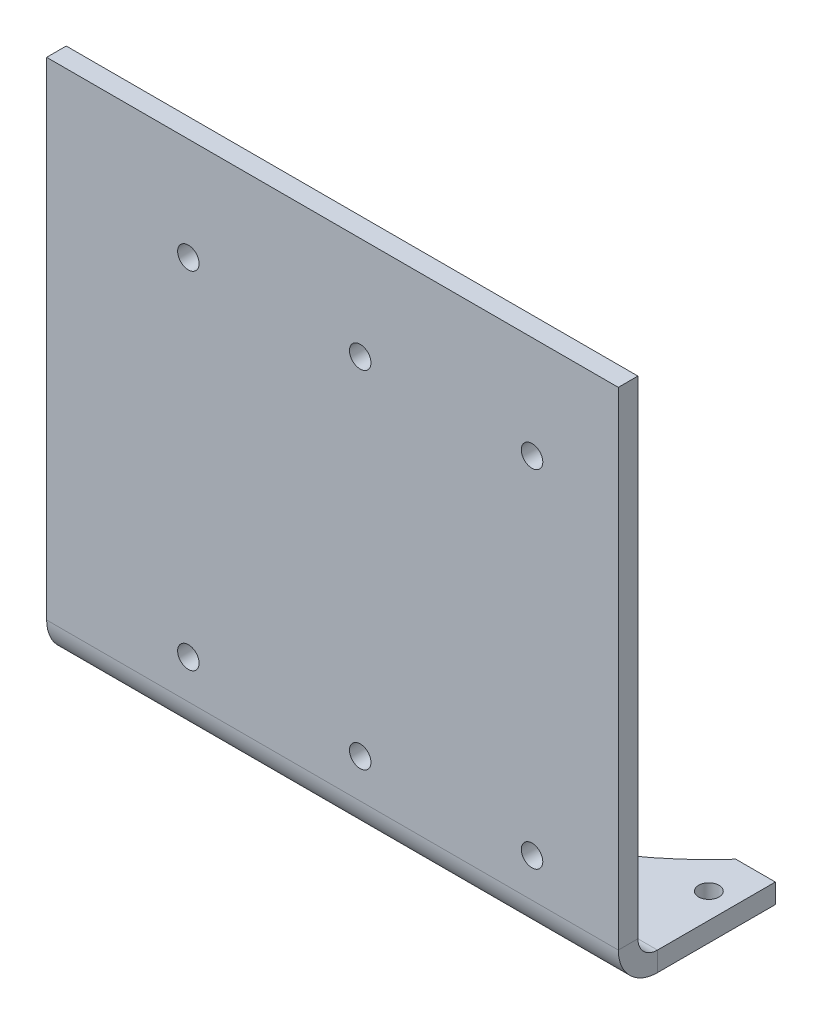
ISO-10303-21;
HEADER;
FILE_DESCRIPTION(('STEP AP214'),'2;1');
FILE_NAME('part.step','',(''),(''),'','','');
FILE_SCHEMA(('AUTOMOTIVE_DESIGN { 1 0 10303 214 1 1 1 1 }'));
ENDSEC;
DATA;
#1=APPLICATION_CONTEXT('core data for automotive mechanical design processes');
#2=APPLICATION_PROTOCOL_DEFINITION('international standard','automotive_design',2000,#1);
#3=PRODUCT_CONTEXT('',#1,'mechanical');
#4=PRODUCT('Part','Part','',(#3));
#5=PRODUCT_RELATED_PRODUCT_CATEGORY('part','',(#4));
#6=PRODUCT_DEFINITION_FORMATION('','',#4);
#7=PRODUCT_DEFINITION_CONTEXT('part definition',#1,'design');
#8=PRODUCT_DEFINITION('design','',#6,#7);
#9=PRODUCT_DEFINITION_SHAPE('','',#8);
#10=(LENGTH_UNIT() NAMED_UNIT(*) SI_UNIT(.MILLI.,.METRE.));
#11=(NAMED_UNIT(*) PLANE_ANGLE_UNIT() SI_UNIT($,.RADIAN.));
#12=(NAMED_UNIT(*) SI_UNIT($,.STERADIAN.) SOLID_ANGLE_UNIT());
#13=UNCERTAINTY_MEASURE_WITH_UNIT(LENGTH_MEASURE(1.E-05),#10,'distance_accuracy_value','');
#14=(GEOMETRIC_REPRESENTATION_CONTEXT(3) GLOBAL_UNCERTAINTY_ASSIGNED_CONTEXT((#13)) GLOBAL_UNIT_ASSIGNED_CONTEXT((#10,
#11,#12)) REPRESENTATION_CONTEXT('',''));
#15=CARTESIAN_POINT('',(0.,0.,0.));
#16=DIRECTION('',(0.,0.,1.));
#17=DIRECTION('',(1.,0.,0.));
#18=AXIS2_PLACEMENT_3D('',#15,#16,#17);
#19=CARTESIAN_POINT('',(84.5,-73.66,-40.64));
#20=DIRECTION('',(1.,0.,0.));
#21=DIRECTION('',(0.,0.,1.));
#22=AXIS2_PLACEMENT_3D('',#19,#20,#21);
#23=PLANE('',#22);
#24=DIRECTION('',(0.,1.,0.));
#25=VECTOR('',#24,1.);
#26=CARTESIAN_POINT('',(84.5,-73.66,-5.790000104));
#27=LINE('',#26,#25);
#28=CARTESIAN_POINT('',(84.5,-79.4500062,-5.790000104));
#29=VERTEX_POINT('',#28);
#30=CARTESIAN_POINT('',(84.5,-73.66,-5.790000104));
#31=VERTEX_POINT('',#30);
#32=EDGE_CURVE('E11',#29,#31,#27,.T.);
#33=ORIENTED_EDGE('',*,*,#32,.F.);
#34=DIRECTION('',(0.,0.,1.));
#35=VECTOR('',#34,1.);
#36=CARTESIAN_POINT('',(84.5,-79.4500062,-40.64));
#37=LINE('',#36,#35);
#38=CARTESIAN_POINT('',(84.5,-79.4500062,-40.64));
#39=VERTEX_POINT('',#38);
#40=EDGE_CURVE('E92',#39,#29,#37,.T.);
#41=ORIENTED_EDGE('',*,*,#40,.F.);
#42=DIRECTION('',(0.,1.,0.));
#43=VECTOR('',#42,1.);
#44=CARTESIAN_POINT('',(84.5,-73.66,-40.64));
#45=LINE('',#44,#43);
#46=CARTESIAN_POINT('',(84.5,-73.66,-40.64));
#47=VERTEX_POINT('',#46);
#48=EDGE_CURVE('E47',#39,#47,#45,.T.);
#49=ORIENTED_EDGE('',*,*,#48,.T.);
#50=DIRECTION('',(0.,0.,1.));
#51=VECTOR('',#50,1.);
#52=CARTESIAN_POINT('',(84.5,-73.66,-40.64));
#53=LINE('',#52,#51);
#54=EDGE_CURVE('E94',#47,#31,#53,.T.);
#55=ORIENTED_EDGE('',*,*,#54,.T.);
#56=EDGE_LOOP('',(#33,#41,#49,#55));
#57=FACE_BOUND('',#56,.T.);
#58=ADVANCED_FACE('F37',(#57),#23,.T.);
#59=CARTESIAN_POINT('',(84.5,-73.66,-40.64));
#60=DIRECTION('',(0.,0.,-1.));
#61=DIRECTION('',(1.,0.,0.));
#62=AXIS2_PLACEMENT_3D('',#59,#60,#61);
#63=PLANE('',#62);
#64=ORIENTED_EDGE('',*,*,#48,.F.);
#65=DIRECTION('',(1.,0.,0.));
#66=VECTOR('',#65,1.);
#67=CARTESIAN_POINT('',(84.5,-79.4500062,-40.64));
#68=LINE('',#67,#66);
#69=CARTESIAN_POINT('',(72.8207111961363,-79.4500062,-40.64));
#70=VERTEX_POINT('',#69);
#71=EDGE_CURVE('E119',#70,#39,#68,.T.);
#72=ORIENTED_EDGE('',*,*,#71,.F.);
#73=DIRECTION('',(0.,1.,0.));
#74=VECTOR('',#73,1.);
#75=CARTESIAN_POINT('',(72.8207111961363,-73.66,-40.64));
#76=LINE('',#75,#74);
#77=CARTESIAN_POINT('',(72.8207111961363,-73.66,-40.64));
#78=VERTEX_POINT('',#77);
#79=EDGE_CURVE('E152',#70,#78,#76,.T.);
#80=ORIENTED_EDGE('',*,*,#79,.T.);
#81=DIRECTION('',(1.,0.,0.));
#82=VECTOR('',#81,1.);
#83=CARTESIAN_POINT('',(84.5,-73.66,-40.64));
#84=LINE('',#83,#82);
#85=EDGE_CURVE('E167',#78,#47,#84,.T.);
#86=ORIENTED_EDGE('',*,*,#85,.T.);
#87=EDGE_LOOP('',(#64,#72,#80,#86));
#88=FACE_BOUND('',#87,.T.);
#89=ADVANCED_FACE('F174',(#88),#63,.T.);
#90=CARTESIAN_POINT('',(0.,-73.66,-105.47358713575));
#91=DIRECTION('',(0.,1.,0.));
#92=DIRECTION('',(-1.,0.,0.));
#93=AXIS2_PLACEMENT_3D('',#90,#91,#92);
#94=CYLINDRICAL_SURFACE('',#93,97.5);
#95=ORIENTED_EDGE('',*,*,#79,.F.);
#96=CARTESIAN_POINT('',(0.,-79.4500062,-105.47358713575));
#97=DIRECTION('',(0.,1.,0.));
#98=DIRECTION('',(-1.,0.,0.));
#99=AXIS2_PLACEMENT_3D('',#96,#97,#98);
#100=CIRCLE('',#99,97.5);
#101=CARTESIAN_POINT('',(-72.8207111961362,-79.4500062,-40.64));
#102=VERTEX_POINT('',#101);
#103=EDGE_CURVE('E264',#102,#70,#100,.T.);
#104=ORIENTED_EDGE('',*,*,#103,.F.);
#105=DIRECTION('',(0.,1.,0.));
#106=VECTOR('',#105,1.);
#107=CARTESIAN_POINT('',(-72.8207111961363,-73.66,-40.64));
#108=LINE('',#107,#106);
#109=CARTESIAN_POINT('',(-72.8207111961363,-73.66,-40.64));
#110=VERTEX_POINT('',#109);
#111=EDGE_CURVE('E149',#102,#110,#108,.T.);
#112=ORIENTED_EDGE('',*,*,#111,.T.);
#113=CARTESIAN_POINT('',(0.,-73.66,-105.47358713575));
#114=DIRECTION('',(0.,1.,0.));
#115=DIRECTION('',(-1.,0.,0.));
#116=AXIS2_PLACEMENT_3D('',#113,#114,#115);
#117=CIRCLE('',#116,97.5);
#118=EDGE_CURVE('E175',#110,#78,#117,.T.);
#119=ORIENTED_EDGE('',*,*,#118,.T.);
#120=EDGE_LOOP('',(#95,#104,#112,#119));
#121=FACE_BOUND('',#120,.T.);
#122=ADVANCED_FACE('F268',(#121),#94,.F.);
#123=ORIENTED_EDGE('',*,*,#111,.F.);
#124=DIRECTION('',(1.,0.,0.));
#125=VECTOR('',#124,1.);
#126=CARTESIAN_POINT('',(84.5,-79.4500062,-40.64));
#127=LINE('',#126,#125);
#128=CARTESIAN_POINT('',(-84.5,-79.4500062,-40.64));
#129=VERTEX_POINT('',#128);
#130=EDGE_CURVE('E261',#129,#102,#127,.T.);
#131=ORIENTED_EDGE('',*,*,#130,.F.);
#132=DIRECTION('',(0.,1.,0.));
#133=VECTOR('',#132,1.);
#134=CARTESIAN_POINT('',(-84.5,-73.66,-40.64));
#135=LINE('',#134,#133);
#136=CARTESIAN_POINT('',(-84.5,-73.66,-40.64));
#137=VERTEX_POINT('',#136);
#138=EDGE_CURVE('E146',#129,#137,#135,.T.);
#139=ORIENTED_EDGE('',*,*,#138,.T.);
#140=EDGE_CURVE('E178',#137,#110,#84,.T.);
#141=ORIENTED_EDGE('',*,*,#140,.T.);
#142=EDGE_LOOP('',(#123,#131,#139,#141));
#143=FACE_BOUND('',#142,.T.);
#144=ADVANCED_FACE('F311',(#143),#63,.T.);
#145=CARTESIAN_POINT('',(-84.5,-73.66,-40.64));
#146=DIRECTION('',(1.,0.,0.));
#147=DIRECTION('',(0.,0.,1.));
#148=AXIS2_PLACEMENT_3D('',#145,#146,#147);
#149=PLANE('',#148);
#150=ORIENTED_EDGE('',*,*,#138,.F.);
#151=DIRECTION('',(0.,0.,1.));
#152=VECTOR('',#151,1.);
#153=CARTESIAN_POINT('',(-84.5,-79.4500062,-40.64));
#154=LINE('',#153,#152);
#155=CARTESIAN_POINT('',(-84.5,-79.4500062,-5.790000104));
#156=VERTEX_POINT('',#155);
#157=EDGE_CURVE('E121',#129,#156,#154,.T.);
#158=ORIENTED_EDGE('',*,*,#157,.T.);
#159=DIRECTION('',(0.,1.,0.));
#160=VECTOR('',#159,1.);
#161=CARTESIAN_POINT('',(-84.5,-73.66,-5.790000104));
#162=LINE('',#161,#160);
#163=CARTESIAN_POINT('',(-84.5,-73.66,-5.790000104));
#164=VERTEX_POINT('',#163);
#165=EDGE_CURVE('E143',#156,#164,#162,.T.);
#166=ORIENTED_EDGE('',*,*,#165,.T.);
#167=DIRECTION('',(0.,0.,1.));
#168=VECTOR('',#167,1.);
#169=CARTESIAN_POINT('',(-84.5,-73.66,-40.64));
#170=LINE('',#169,#168);
#171=EDGE_CURVE('E172',#137,#164,#170,.T.);
#172=ORIENTED_EDGE('',*,*,#171,.F.);
#173=EDGE_LOOP('',(#150,#158,#166,#172));
#174=FACE_BOUND('',#173,.T.);
#175=ADVANCED_FACE('F277',(#174),#149,.F.);
#176=CARTESIAN_POINT('',(-84.5,-67.869999896,-5.790000104));
#177=DIRECTION('',(1.,0.,0.));
#178=DIRECTION('',(0.,0.,-1.));
#179=AXIS2_PLACEMENT_3D('',#176,#177,#178);
#180=PLANE('',#179);
#181=ORIENTED_EDGE('',*,*,#165,.F.);
#182=CARTESIAN_POINT('',(-84.5,-67.869999896,-5.790000104));
#183=DIRECTION('',(1.,0.,0.));
#184=DIRECTION('',(0.,1.,0.));
#185=AXIS2_PLACEMENT_3D('',#182,#183,#184);
#186=CIRCLE('',#185,11.580006304);
#187=CARTESIAN_POINT('',(-84.5,-67.869999896,5.7900062));
#188=VERTEX_POINT('',#187);
#189=EDGE_CURVE('E108',#156,#188,#186,.F.);
#190=ORIENTED_EDGE('',*,*,#189,.T.);
#191=DIRECTION('',(0.,0.,-1.));
#192=VECTOR('',#191,1.);
#193=CARTESIAN_POINT('',(-84.5,-67.869999896,0.));
#194=LINE('',#193,#192);
#195=CARTESIAN_POINT('',(-84.5,-67.869999896,0.));
#196=VERTEX_POINT('',#195);
#197=EDGE_CURVE('E141',#188,#196,#194,.T.);
#198=ORIENTED_EDGE('',*,*,#197,.T.);
#199=CARTESIAN_POINT('',(-84.5,-67.869999896,-5.790000104));
#200=DIRECTION('',(-1.,0.,0.));
#201=DIRECTION('',(0.,0.,1.));
#202=AXIS2_PLACEMENT_3D('',#199,#200,#201);
#203=CIRCLE('',#202,5.790000104);
#204=EDGE_CURVE('E231',#164,#196,#203,.T.);
#205=ORIENTED_EDGE('',*,*,#204,.F.);
#206=EDGE_LOOP('',(#181,#190,#198,#205));
#207=FACE_BOUND('',#206,.T.);
#208=ADVANCED_FACE('F279',(#207),#180,.F.);
#209=CARTESIAN_POINT('',(-84.5,-76.2,0.));
#210=DIRECTION('',(1.,0.,0.));
#211=DIRECTION('',(0.,-1.,0.));
#212=AXIS2_PLACEMENT_3D('',#209,#210,#211);
#213=PLANE('',#212);
#214=ORIENTED_EDGE('',*,*,#197,.F.);
#215=DIRECTION('',(0.,1.,0.));
#216=VECTOR('',#215,1.);
#217=CARTESIAN_POINT('',(-84.5,0.,5.7900062));
#218=LINE('',#217,#216);
#219=CARTESIAN_POINT('',(-84.5,76.2,5.7900062));
#220=VERTEX_POINT('',#219);
#221=EDGE_CURVE('E252',#220,#188,#218,.F.);
#222=ORIENTED_EDGE('',*,*,#221,.F.);
#223=DIRECTION('',(0.,0.,-1.));
#224=VECTOR('',#223,1.);
#225=CARTESIAN_POINT('',(-84.5,76.2,0.));
#226=LINE('',#225,#224);
#227=CARTESIAN_POINT('',(-84.5,76.2,0.));
#228=VERTEX_POINT('',#227);
#229=EDGE_CURVE('E138',#220,#228,#226,.T.);
#230=ORIENTED_EDGE('',*,*,#229,.T.);
#231=DIRECTION('',(0.,-1.,0.));
#232=VECTOR('',#231,1.);
#233=CARTESIAN_POINT('',(-84.5,-76.2,0.));
#234=LINE('',#233,#232);
#235=EDGE_CURVE('E213',#228,#196,#234,.T.);
#236=ORIENTED_EDGE('',*,*,#235,.T.);
#237=EDGE_LOOP('',(#214,#222,#230,#236));
#238=FACE_BOUND('',#237,.T.);
#239=ADVANCED_FACE('F296',(#238),#213,.F.);
#240=CARTESIAN_POINT('',(-84.5,76.2,0.));
#241=DIRECTION('',(0.,-1.,0.));
#242=DIRECTION('',(-1.,0.,0.));
#243=AXIS2_PLACEMENT_3D('',#240,#241,#242);
#244=PLANE('',#243);
#245=ORIENTED_EDGE('',*,*,#229,.F.);
#246=DIRECTION('',(-1.,0.,0.));
#247=VECTOR('',#246,1.);
#248=CARTESIAN_POINT('',(0.,76.2,5.7900062));
#249=LINE('',#248,#247);
#250=CARTESIAN_POINT('',(84.5,76.2,5.7900062));
#251=VERTEX_POINT('',#250);
#252=EDGE_CURVE('E255',#251,#220,#249,.T.);
#253=ORIENTED_EDGE('',*,*,#252,.F.);
#254=DIRECTION('',(0.,0.,-1.));
#255=VECTOR('',#254,1.);
#256=CARTESIAN_POINT('',(84.5,76.2,0.));
#257=LINE('',#256,#255);
#258=CARTESIAN_POINT('',(84.5,76.2,0.));
#259=VERTEX_POINT('',#258);
#260=EDGE_CURVE('E135',#251,#259,#257,.T.);
#261=ORIENTED_EDGE('',*,*,#260,.T.);
#262=DIRECTION('',(-1.,0.,0.));
#263=VECTOR('',#262,1.);
#264=CARTESIAN_POINT('',(-84.5,76.2,0.));
#265=LINE('',#264,#263);
#266=EDGE_CURVE('E216',#259,#228,#265,.T.);
#267=ORIENTED_EDGE('',*,*,#266,.T.);
#268=EDGE_LOOP('',(#245,#253,#261,#267));
#269=FACE_BOUND('',#268,.T.);
#270=ADVANCED_FACE('F291',(#269),#244,.F.);
#271=CARTESIAN_POINT('',(84.5,-76.2,0.));
#272=DIRECTION('',(-1.,0.,0.));
#273=DIRECTION('',(0.,1.,0.));
#274=AXIS2_PLACEMENT_3D('',#271,#272,#273);
#275=PLANE('',#274);
#276=ORIENTED_EDGE('',*,*,#260,.F.);
#277=DIRECTION('',(0.,1.,0.));
#278=VECTOR('',#277,1.);
#279=CARTESIAN_POINT('',(84.5,0.,5.7900062));
#280=LINE('',#279,#278);
#281=CARTESIAN_POINT('',(84.5,-67.869999896,5.7900062));
#282=VERTEX_POINT('',#281);
#283=EDGE_CURVE('E113',#282,#251,#280,.T.);
#284=ORIENTED_EDGE('',*,*,#283,.F.);
#285=DIRECTION('',(0.,0.,-1.));
#286=VECTOR('',#285,1.);
#287=CARTESIAN_POINT('',(84.5,-67.869999896,0.));
#288=LINE('',#287,#286);
#289=CARTESIAN_POINT('',(84.5,-67.869999896,0.));
#290=VERTEX_POINT('',#289);
#291=EDGE_CURVE('E41',#282,#290,#288,.T.);
#292=ORIENTED_EDGE('',*,*,#291,.T.);
#293=DIRECTION('',(0.,1.,0.));
#294=VECTOR('',#293,1.);
#295=CARTESIAN_POINT('',(84.5,-76.2,0.));
#296=LINE('',#295,#294);
#297=EDGE_CURVE('E221',#290,#259,#296,.T.);
#298=ORIENTED_EDGE('',*,*,#297,.T.);
#299=EDGE_LOOP('',(#276,#284,#292,#298));
#300=FACE_BOUND('',#299,.T.);
#301=ADVANCED_FACE('F288',(#300),#275,.F.);
#302=CARTESIAN_POINT('',(-77.,-73.66,-28.4735871357502));
#303=DIRECTION('',(0.,1.,0.));
#304=DIRECTION('',(-1.,0.,0.));
#305=AXIS2_PLACEMENT_3D('',#302,#303,#304);
#306=CYLINDRICAL_SURFACE('',#305,3.02087156365502);
#307=CARTESIAN_POINT('',(-77.,-73.66,-28.4735871357502));
#308=DIRECTION('',(0.,1.,0.));
#309=DIRECTION('',(-1.,0.,0.));
#310=AXIS2_PLACEMENT_3D('',#307,#308,#309);
#311=CIRCLE('',#310,3.02087156365502);
#312=CARTESIAN_POINT('',(-80.020871563655,-73.66,-28.4735871357502));
#313=VERTEX_POINT('',#312);
#314=EDGE_CURVE('E181',#313,#313,#311,.T.);
#315=ORIENTED_EDGE('',*,*,#314,.T.);
#316=EDGE_LOOP('',(#315));
#317=FACE_BOUND('',#316,.T.);
#318=CARTESIAN_POINT('',(-77.,-79.4500062,-28.4735871357502));
#319=DIRECTION('',(0.,1.,0.));
#320=DIRECTION('',(-1.,0.,0.));
#321=AXIS2_PLACEMENT_3D('',#318,#319,#320);
#322=CIRCLE('',#321,3.02087156365502);
#323=CARTESIAN_POINT('',(-80.020871563655,-79.4500062,-28.4735871357502));
#324=VERTEX_POINT('',#323);
#325=EDGE_CURVE('E126',#324,#324,#322,.T.);
#326=ORIENTED_EDGE('',*,*,#325,.F.);
#327=EDGE_LOOP('',(#326));
#328=FACE_BOUND('',#327,.T.);
#329=ADVANCED_FACE('F316',(#317,#328),#306,.F.);
#330=CARTESIAN_POINT('',(77.,-73.66,-28.4735871357502));
#331=DIRECTION('',(0.,1.,0.));
#332=DIRECTION('',(-1.,0.,0.));
#333=AXIS2_PLACEMENT_3D('',#330,#331,#332);
#334=CYLINDRICAL_SURFACE('',#333,3.02087156365502);
#335=CARTESIAN_POINT('',(77.,-73.66,-28.4735871357502));
#336=DIRECTION('',(0.,1.,0.));
#337=DIRECTION('',(-1.,0.,0.));
#338=AXIS2_PLACEMENT_3D('',#335,#336,#337);
#339=CIRCLE('',#338,3.02087156365502);
#340=CARTESIAN_POINT('',(73.979128436345,-73.66,-28.4735871357502));
#341=VERTEX_POINT('',#340);
#342=EDGE_CURVE('E176',#341,#341,#339,.T.);
#343=ORIENTED_EDGE('',*,*,#342,.T.);
#344=EDGE_LOOP('',(#343));
#345=FACE_BOUND('',#344,.T.);
#346=CARTESIAN_POINT('',(77.,-79.4500062,-28.4735871357502));
#347=DIRECTION('',(0.,1.,0.));
#348=DIRECTION('',(-1.,0.,0.));
#349=AXIS2_PLACEMENT_3D('',#346,#347,#348);
#350=CIRCLE('',#349,3.02087156365502);
#351=CARTESIAN_POINT('',(73.979128436345,-79.4500062,-28.4735871357502));
#352=VERTEX_POINT('',#351);
#353=EDGE_CURVE('E132',#352,#352,#350,.T.);
#354=ORIENTED_EDGE('',*,*,#353,.F.);
#355=EDGE_LOOP('',(#354));
#356=FACE_BOUND('',#355,.T.);
#357=ADVANCED_FACE('F39',(#345,#356),#334,.F.);
#358=CARTESIAN_POINT('',(8.19999999999999,-56.4,0.));
#359=DIRECTION('',(0.,0.,-1.));
#360=DIRECTION('',(-1.,0.,0.));
#361=AXIS2_PLACEMENT_3D('',#358,#359,#360);
#362=CYLINDRICAL_SURFACE('',#361,3.175);
#363=CARTESIAN_POINT('',(8.19999999999999,-56.4,0.));
#364=DIRECTION('',(0.,0.,-1.));
#365=DIRECTION('',(-1.,0.,0.));
#366=AXIS2_PLACEMENT_3D('',#363,#364,#365);
#367=CIRCLE('',#366,3.175);
#368=CARTESIAN_POINT('',(5.02499999999999,-56.4,0.));
#369=VERTEX_POINT('',#368);
#370=EDGE_CURVE('E171',#369,#369,#367,.T.);
#371=ORIENTED_EDGE('',*,*,#370,.T.);
#372=EDGE_LOOP('',(#371));
#373=FACE_BOUND('',#372,.T.);
#374=CARTESIAN_POINT('',(8.19999999999999,-56.4,5.7900062));
#375=DIRECTION('',(0.,0.,-1.));
#376=DIRECTION('',(-1.,0.,0.));
#377=AXIS2_PLACEMENT_3D('',#374,#375,#376);
#378=CIRCLE('',#377,3.175);
#379=CARTESIAN_POINT('',(5.02499999999999,-56.4,5.7900062));
#380=VERTEX_POINT('',#379);
#381=EDGE_CURVE('E120',#380,#380,#378,.T.);
#382=ORIENTED_EDGE('',*,*,#381,.F.);
#383=EDGE_LOOP('',(#382));
#384=FACE_BOUND('',#383,.T.);
#385=ADVANCED_FACE('F323',(#373,#384),#362,.F.);
#386=CARTESIAN_POINT('',(-42.6,-56.4,0.));
#387=DIRECTION('',(0.,0.,-1.));
#388=DIRECTION('',(-1.,0.,0.));
#389=AXIS2_PLACEMENT_3D('',#386,#387,#388);
#390=CYLINDRICAL_SURFACE('',#389,3.175);
#391=CARTESIAN_POINT('',(-42.6,-56.4,0.));
#392=DIRECTION('',(0.,0.,-1.));
#393=DIRECTION('',(-1.,0.,0.));
#394=AXIS2_PLACEMENT_3D('',#391,#392,#393);
#395=CIRCLE('',#394,3.175);
#396=CARTESIAN_POINT('',(-45.775,-56.4,0.));
#397=VERTEX_POINT('',#396);
#398=EDGE_CURVE('E198',#397,#397,#395,.T.);
#399=ORIENTED_EDGE('',*,*,#398,.T.);
#400=EDGE_LOOP('',(#399));
#401=FACE_BOUND('',#400,.T.);
#402=CARTESIAN_POINT('',(-42.6,-56.4,5.7900062));
#403=DIRECTION('',(0.,0.,-1.));
#404=DIRECTION('',(-1.,0.,0.));
#405=AXIS2_PLACEMENT_3D('',#402,#403,#404);
#406=CIRCLE('',#405,3.175);
#407=CARTESIAN_POINT('',(-45.775,-56.4,5.7900062));
#408=VERTEX_POINT('',#407);
#409=EDGE_CURVE('E237',#408,#408,#406,.T.);
#410=ORIENTED_EDGE('',*,*,#409,.F.);
#411=EDGE_LOOP('',(#410));
#412=FACE_BOUND('',#411,.T.);
#413=ADVANCED_FACE('F347',(#401,#412),#390,.F.);
#414=CARTESIAN_POINT('',(-42.6,45.9,0.));
#415=DIRECTION('',(0.,0.,-1.));
#416=DIRECTION('',(-1.,0.,0.));
#417=AXIS2_PLACEMENT_3D('',#414,#415,#416);
#418=CYLINDRICAL_SURFACE('',#417,3.175);
#419=CARTESIAN_POINT('',(-42.6,45.9,0.));
#420=DIRECTION('',(0.,0.,-1.));
#421=DIRECTION('',(-1.,0.,0.));
#422=AXIS2_PLACEMENT_3D('',#419,#420,#421);
#423=CIRCLE('',#422,3.175);
#424=CARTESIAN_POINT('',(-45.775,45.9,0.));
#425=VERTEX_POINT('',#424);
#426=EDGE_CURVE('E201',#425,#425,#423,.T.);
#427=ORIENTED_EDGE('',*,*,#426,.T.);
#428=EDGE_LOOP('',(#427));
#429=FACE_BOUND('',#428,.T.);
#430=CARTESIAN_POINT('',(-42.6,45.9,5.7900062));
#431=DIRECTION('',(0.,0.,-1.));
#432=DIRECTION('',(-1.,0.,0.));
#433=AXIS2_PLACEMENT_3D('',#430,#431,#432);
#434=CIRCLE('',#433,3.175);
#435=CARTESIAN_POINT('',(-45.775,45.9,5.7900062));
#436=VERTEX_POINT('',#435);
#437=EDGE_CURVE('E240',#436,#436,#434,.T.);
#438=ORIENTED_EDGE('',*,*,#437,.F.);
#439=EDGE_LOOP('',(#438));
#440=FACE_BOUND('',#439,.T.);
#441=ADVANCED_FACE('F351',(#429,#440),#418,.F.);
#442=CARTESIAN_POINT('',(59.,-56.4,0.));
#443=DIRECTION('',(0.,0.,-1.));
#444=DIRECTION('',(-1.,0.,0.));
#445=AXIS2_PLACEMENT_3D('',#442,#443,#444);
#446=CYLINDRICAL_SURFACE('',#445,3.175);
#447=CARTESIAN_POINT('',(59.,-56.4,0.));
#448=DIRECTION('',(0.,0.,-1.));
#449=DIRECTION('',(-1.,0.,0.));
#450=AXIS2_PLACEMENT_3D('',#447,#448,#449);
#451=CIRCLE('',#450,3.175);
#452=CARTESIAN_POINT('',(55.825,-56.4,0.));
#453=VERTEX_POINT('',#452);
#454=EDGE_CURVE('E204',#453,#453,#451,.T.);
#455=ORIENTED_EDGE('',*,*,#454,.T.);
#456=EDGE_LOOP('',(#455));
#457=FACE_BOUND('',#456,.T.);
#458=CARTESIAN_POINT('',(59.,-56.4,5.7900062));
#459=DIRECTION('',(0.,0.,-1.));
#460=DIRECTION('',(-1.,0.,0.));
#461=AXIS2_PLACEMENT_3D('',#458,#459,#460);
#462=CIRCLE('',#461,3.175);
#463=CARTESIAN_POINT('',(55.825,-56.4,5.7900062));
#464=VERTEX_POINT('',#463);
#465=EDGE_CURVE('E243',#464,#464,#462,.T.);
#466=ORIENTED_EDGE('',*,*,#465,.F.);
#467=EDGE_LOOP('',(#466));
#468=FACE_BOUND('',#467,.T.);
#469=ADVANCED_FACE('F355',(#457,#468),#446,.F.);
#470=CARTESIAN_POINT('',(8.19999999999999,45.9,0.));
#471=DIRECTION('',(0.,0.,-1.));
#472=DIRECTION('',(-1.,0.,0.));
#473=AXIS2_PLACEMENT_3D('',#470,#471,#472);
#474=CYLINDRICAL_SURFACE('',#473,3.175);
#475=CARTESIAN_POINT('',(8.19999999999999,45.9,0.));
#476=DIRECTION('',(0.,0.,-1.));
#477=DIRECTION('',(-1.,0.,0.));
#478=AXIS2_PLACEMENT_3D('',#475,#476,#477);
#479=CIRCLE('',#478,3.175);
#480=CARTESIAN_POINT('',(5.02499999999999,45.9,0.));
#481=VERTEX_POINT('',#480);
#482=EDGE_CURVE('E207',#481,#481,#479,.T.);
#483=ORIENTED_EDGE('',*,*,#482,.T.);
#484=EDGE_LOOP('',(#483));
#485=FACE_BOUND('',#484,.T.);
#486=CARTESIAN_POINT('',(8.19999999999999,45.9,5.7900062));
#487=DIRECTION('',(0.,0.,-1.));
#488=DIRECTION('',(-1.,0.,0.));
#489=AXIS2_PLACEMENT_3D('',#486,#487,#488);
#490=CIRCLE('',#489,3.175);
#491=CARTESIAN_POINT('',(5.02499999999999,45.9,5.7900062));
#492=VERTEX_POINT('',#491);
#493=EDGE_CURVE('E246',#492,#492,#490,.T.);
#494=ORIENTED_EDGE('',*,*,#493,.F.);
#495=EDGE_LOOP('',(#494));
#496=FACE_BOUND('',#495,.T.);
#497=ADVANCED_FACE('F359',(#485,#496),#474,.F.);
#498=CARTESIAN_POINT('',(59.,45.9,0.));
#499=DIRECTION('',(0.,0.,-1.));
#500=DIRECTION('',(-1.,0.,0.));
#501=AXIS2_PLACEMENT_3D('',#498,#499,#500);
#502=CYLINDRICAL_SURFACE('',#501,3.175);
#503=CARTESIAN_POINT('',(59.,45.9,0.));
#504=DIRECTION('',(0.,0.,-1.));
#505=DIRECTION('',(-1.,0.,0.));
#506=AXIS2_PLACEMENT_3D('',#503,#504,#505);
#507=CIRCLE('',#506,3.175);
#508=CARTESIAN_POINT('',(55.825,45.9,0.));
#509=VERTEX_POINT('',#508);
#510=EDGE_CURVE('E210',#509,#509,#507,.T.);
#511=ORIENTED_EDGE('',*,*,#510,.T.);
#512=EDGE_LOOP('',(#511));
#513=FACE_BOUND('',#512,.T.);
#514=CARTESIAN_POINT('',(59.,45.9,5.7900062));
#515=DIRECTION('',(0.,0.,-1.));
#516=DIRECTION('',(-1.,0.,0.));
#517=AXIS2_PLACEMENT_3D('',#514,#515,#516);
#518=CIRCLE('',#517,3.175);
#519=CARTESIAN_POINT('',(55.825,45.9,5.7900062));
#520=VERTEX_POINT('',#519);
#521=EDGE_CURVE('E249',#520,#520,#518,.T.);
#522=ORIENTED_EDGE('',*,*,#521,.F.);
#523=EDGE_LOOP('',(#522));
#524=FACE_BOUND('',#523,.T.);
#525=ADVANCED_FACE('F315',(#513,#524),#502,.F.);
#526=CARTESIAN_POINT('',(84.5,-67.869999896,-5.790000104));
#527=DIRECTION('',(1.,0.,0.));
#528=DIRECTION('',(0.,0.,-1.));
#529=AXIS2_PLACEMENT_3D('',#526,#527,#528);
#530=PLANE('',#529);
#531=CARTESIAN_POINT('',(84.5,-67.869999896,-5.790000104));
#532=DIRECTION('',(1.,0.,0.));
#533=DIRECTION('',(0.,1.,0.));
#534=AXIS2_PLACEMENT_3D('',#531,#532,#533);
#535=CIRCLE('',#534,11.580006304);
#536=EDGE_CURVE('E106',#282,#29,#535,.T.);
#537=ORIENTED_EDGE('',*,*,#536,.T.);
#538=ORIENTED_EDGE('',*,*,#32,.T.);
#539=CARTESIAN_POINT('',(84.5,-67.869999896,-5.790000104));
#540=DIRECTION('',(-1.,0.,0.));
#541=DIRECTION('',(0.,0.,1.));
#542=AXIS2_PLACEMENT_3D('',#539,#540,#541);
#543=CIRCLE('',#542,5.790000104);
#544=EDGE_CURVE('E229',#290,#31,#543,.F.);
#545=ORIENTED_EDGE('',*,*,#544,.F.);
#546=ORIENTED_EDGE('',*,*,#291,.F.);
#547=EDGE_LOOP('',(#537,#538,#545,#546));
#548=FACE_BOUND('',#547,.T.);
#549=ADVANCED_FACE('F123',(#548),#530,.T.);
#550=CARTESIAN_POINT('',(0.,0.,0.));
#551=DIRECTION('',(0.,0.,-1.));
#552=DIRECTION('',(-1.,0.,0.));
#553=AXIS2_PLACEMENT_3D('',#550,#551,#552);
#554=PLANE('',#553);
#555=ORIENTED_EDGE('',*,*,#370,.F.);
#556=EDGE_LOOP('',(#555));
#557=FACE_BOUND('',#556,.T.);
#558=ORIENTED_EDGE('',*,*,#398,.F.);
#559=EDGE_LOOP('',(#558));
#560=FACE_BOUND('',#559,.T.);
#561=ORIENTED_EDGE('',*,*,#426,.F.);
#562=EDGE_LOOP('',(#561));
#563=FACE_BOUND('',#562,.T.);
#564=ORIENTED_EDGE('',*,*,#454,.F.);
#565=EDGE_LOOP('',(#564));
#566=FACE_BOUND('',#565,.T.);
#567=ORIENTED_EDGE('',*,*,#482,.F.);
#568=EDGE_LOOP('',(#567));
#569=FACE_BOUND('',#568,.T.);
#570=ORIENTED_EDGE('',*,*,#510,.F.);
#571=EDGE_LOOP('',(#570));
#572=FACE_BOUND('',#571,.T.);
#573=ORIENTED_EDGE('',*,*,#297,.F.);
#574=DIRECTION('',(1.,0.,0.));
#575=VECTOR('',#574,1.);
#576=CARTESIAN_POINT('',(0.,-67.869999896,0.));
#577=LINE('',#576,#575);
#578=EDGE_CURVE('E226',#290,#196,#577,.F.);
#579=ORIENTED_EDGE('',*,*,#578,.T.);
#580=ORIENTED_EDGE('',*,*,#235,.F.);
#581=ORIENTED_EDGE('',*,*,#266,.F.);
#582=EDGE_LOOP('',(#573,#579,#580,#581));
#583=FACE_BOUND('',#582,.T.);
#584=ADVANCED_FACE('F286',(#557,#560,#563,#566,#569,#572,#583),#554,.T.);
#585=CARTESIAN_POINT('',(84.5,-73.66,-40.64));
#586=DIRECTION('',(0.,-1.,0.));
#587=DIRECTION('',(1.,0.,0.));
#588=AXIS2_PLACEMENT_3D('',#585,#586,#587);
#589=PLANE('',#588);
#590=ORIENTED_EDGE('',*,*,#314,.F.);
#591=EDGE_LOOP('',(#590));
#592=FACE_BOUND('',#591,.T.);
#593=ORIENTED_EDGE('',*,*,#342,.F.);
#594=EDGE_LOOP('',(#593));
#595=FACE_BOUND('',#594,.T.);
#596=ORIENTED_EDGE('',*,*,#171,.T.);
#597=DIRECTION('',(1.,0.,0.));
#598=VECTOR('',#597,1.);
#599=CARTESIAN_POINT('',(84.5,-73.66,-5.790000104));
#600=LINE('',#599,#598);
#601=EDGE_CURVE('E170',#164,#31,#600,.T.);
#602=ORIENTED_EDGE('',*,*,#601,.T.);
#603=ORIENTED_EDGE('',*,*,#54,.F.);
#604=ORIENTED_EDGE('',*,*,#85,.F.);
#605=ORIENTED_EDGE('',*,*,#118,.F.);
#606=ORIENTED_EDGE('',*,*,#140,.F.);
#607=EDGE_LOOP('',(#596,#602,#603,#604,#605,#606));
#608=FACE_BOUND('',#607,.T.);
#609=ADVANCED_FACE('F164',(#592,#595,#608),#589,.F.);
#610=CARTESIAN_POINT('',(84.5,-67.869999896,-5.790000104));
#611=DIRECTION('',(1.,0.,0.));
#612=DIRECTION('',(0.,1.,0.));
#613=AXIS2_PLACEMENT_3D('',#610,#611,#612);
#614=CYLINDRICAL_SURFACE('',#613,5.790000104);
#615=ORIENTED_EDGE('',*,*,#204,.T.);
#616=ORIENTED_EDGE('',*,*,#578,.F.);
#617=ORIENTED_EDGE('',*,*,#544,.T.);
#618=ORIENTED_EDGE('',*,*,#601,.F.);
#619=EDGE_LOOP('',(#615,#616,#617,#618));
#620=FACE_BOUND('',#619,.T.);
#621=ADVANCED_FACE('F282',(#620),#614,.F.);
#622=CARTESIAN_POINT('',(0.,0.,5.7900062));
#623=DIRECTION('',(0.,0.,-1.));
#624=DIRECTION('',(-1.,0.,0.));
#625=AXIS2_PLACEMENT_3D('',#622,#623,#624);
#626=PLANE('',#625);
#627=ORIENTED_EDGE('',*,*,#381,.T.);
#628=EDGE_LOOP('',(#627));
#629=FACE_BOUND('',#628,.T.);
#630=ORIENTED_EDGE('',*,*,#409,.T.);
#631=EDGE_LOOP('',(#630));
#632=FACE_BOUND('',#631,.T.);
#633=ORIENTED_EDGE('',*,*,#437,.T.);
#634=EDGE_LOOP('',(#633));
#635=FACE_BOUND('',#634,.T.);
#636=ORIENTED_EDGE('',*,*,#465,.T.);
#637=EDGE_LOOP('',(#636));
#638=FACE_BOUND('',#637,.T.);
#639=ORIENTED_EDGE('',*,*,#493,.T.);
#640=EDGE_LOOP('',(#639));
#641=FACE_BOUND('',#640,.T.);
#642=ORIENTED_EDGE('',*,*,#521,.T.);
#643=EDGE_LOOP('',(#642));
#644=FACE_BOUND('',#643,.T.);
#645=ORIENTED_EDGE('',*,*,#283,.T.);
#646=ORIENTED_EDGE('',*,*,#252,.T.);
#647=ORIENTED_EDGE('',*,*,#221,.T.);
#648=DIRECTION('',(-1.,0.,0.));
#649=VECTOR('',#648,1.);
#650=CARTESIAN_POINT('',(0.,-67.869999896,5.7900062));
#651=LINE('',#650,#649);
#652=EDGE_CURVE('E112',#282,#188,#651,.T.);
#653=ORIENTED_EDGE('',*,*,#652,.F.);
#654=EDGE_LOOP('',(#645,#646,#647,#653));
#655=FACE_BOUND('',#654,.T.);
#656=ADVANCED_FACE('F294',(#629,#632,#635,#638,#641,#644,#655),#626,.F.);
#657=CARTESIAN_POINT('',(84.5,-79.4500062,-40.64));
#658=DIRECTION('',(0.,-1.,0.));
#659=DIRECTION('',(1.,0.,0.));
#660=AXIS2_PLACEMENT_3D('',#657,#658,#659);
#661=PLANE('',#660);
#662=ORIENTED_EDGE('',*,*,#325,.T.);
#663=EDGE_LOOP('',(#662));
#664=FACE_BOUND('',#663,.T.);
#665=ORIENTED_EDGE('',*,*,#353,.T.);
#666=EDGE_LOOP('',(#665));
#667=FACE_BOUND('',#666,.T.);
#668=ORIENTED_EDGE('',*,*,#157,.F.);
#669=ORIENTED_EDGE('',*,*,#130,.T.);
#670=ORIENTED_EDGE('',*,*,#103,.T.);
#671=ORIENTED_EDGE('',*,*,#71,.T.);
#672=ORIENTED_EDGE('',*,*,#40,.T.);
#673=DIRECTION('',(1.,0.,0.));
#674=VECTOR('',#673,1.);
#675=CARTESIAN_POINT('',(84.5,-79.4500062,-5.790000104));
#676=LINE('',#675,#674);
#677=EDGE_CURVE('E103',#156,#29,#676,.T.);
#678=ORIENTED_EDGE('',*,*,#677,.F.);
#679=EDGE_LOOP('',(#668,#669,#670,#671,#672,#678));
#680=FACE_BOUND('',#679,.T.);
#681=ADVANCED_FACE('F116',(#664,#667,#680),#661,.T.);
#682=CARTESIAN_POINT('',(84.5,-67.869999896,-5.790000104));
#683=DIRECTION('',(1.,0.,0.));
#684=DIRECTION('',(0.,1.,0.));
#685=AXIS2_PLACEMENT_3D('',#682,#683,#684);
#686=CYLINDRICAL_SURFACE('',#685,11.580006304);
#687=ORIENTED_EDGE('',*,*,#189,.F.);
#688=ORIENTED_EDGE('',*,*,#677,.T.);
#689=ORIENTED_EDGE('',*,*,#536,.F.);
#690=ORIENTED_EDGE('',*,*,#652,.T.);
#691=EDGE_LOOP('',(#687,#688,#689,#690));
#692=FACE_BOUND('',#691,.T.);
#693=ADVANCED_FACE('F104',(#692),#686,.T.);
#694=CLOSED_SHELL('',(#58,#89,#122,#144,#175,#208,#239,#270,#301,#329,#357,#385,#413,#441,#469,
#497,#525,#549,#584,#609,#621,#656,#681,#693));
#695=MANIFOLD_SOLID_BREP('B2',#694);
#696=ADVANCED_BREP_SHAPE_REPRESENTATION('',(#18,#695),#14);
#697=SHAPE_DEFINITION_REPRESENTATION(#9,#696);
ENDSEC;
END-ISO-10303-21;
